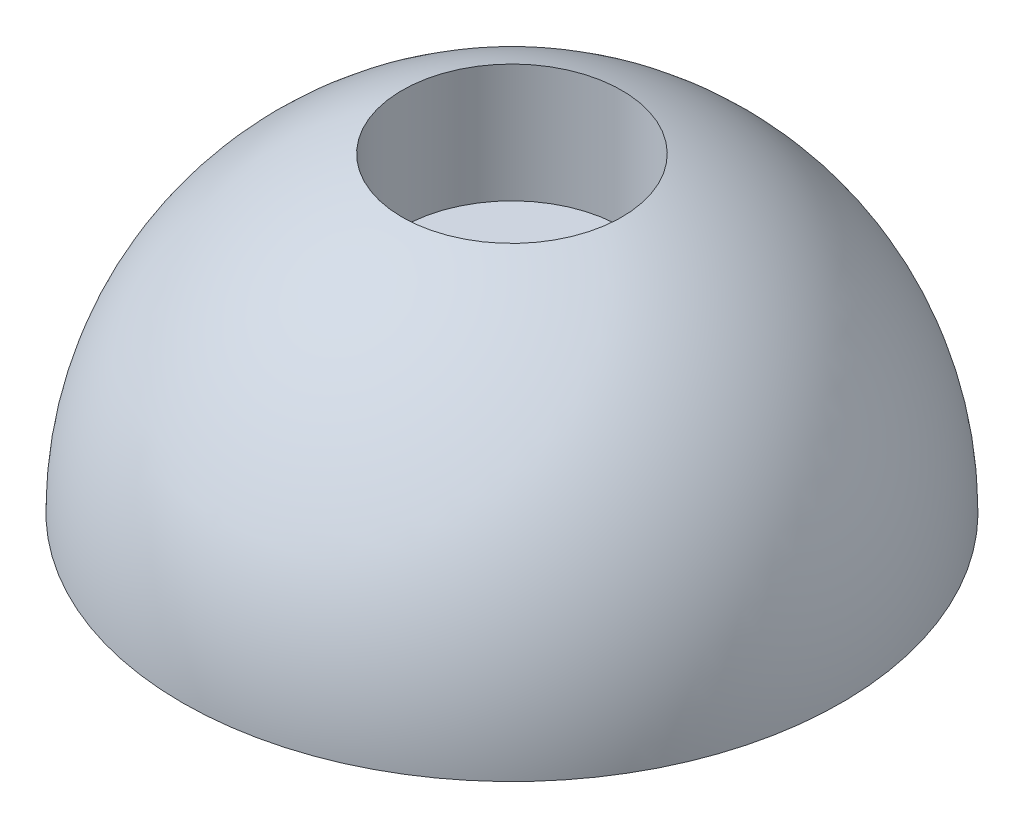
ISO-10303-21;
HEADER;
FILE_DESCRIPTION(('STEP AP214'),'2;1');
FILE_NAME('part.step','',(''),(''),'','','');
FILE_SCHEMA(('AUTOMOTIVE_DESIGN { 1 0 10303 214 1 1 1 1 }'));
ENDSEC;
DATA;
#1=APPLICATION_CONTEXT('core data for automotive mechanical design processes');
#2=APPLICATION_PROTOCOL_DEFINITION('international standard','automotive_design',2000,#1);
#3=PRODUCT_CONTEXT('',#1,'mechanical');
#4=PRODUCT('Part','Part','',(#3));
#5=PRODUCT_RELATED_PRODUCT_CATEGORY('part','',(#4));
#6=PRODUCT_DEFINITION_FORMATION('','',#4);
#7=PRODUCT_DEFINITION_CONTEXT('part definition',#1,'design');
#8=PRODUCT_DEFINITION('design','',#6,#7);
#9=PRODUCT_DEFINITION_SHAPE('','',#8);
#10=(LENGTH_UNIT() NAMED_UNIT(*) SI_UNIT(.MILLI.,.METRE.));
#11=(NAMED_UNIT(*) PLANE_ANGLE_UNIT() SI_UNIT($,.RADIAN.));
#12=(NAMED_UNIT(*) SI_UNIT($,.STERADIAN.) SOLID_ANGLE_UNIT());
#13=UNCERTAINTY_MEASURE_WITH_UNIT(LENGTH_MEASURE(1.E-05),#10,'distance_accuracy_value','');
#14=(GEOMETRIC_REPRESENTATION_CONTEXT(3) GLOBAL_UNCERTAINTY_ASSIGNED_CONTEXT((#13)) GLOBAL_UNIT_ASSIGNED_CONTEXT((#10,
#11,#12)) REPRESENTATION_CONTEXT('',''));
#15=CARTESIAN_POINT('',(0.,0.,0.));
#16=DIRECTION('',(0.,0.,1.));
#17=DIRECTION('',(1.,0.,0.));
#18=AXIS2_PLACEMENT_3D('',#15,#16,#17);
#19=CARTESIAN_POINT('',(0.,-8.334375,0.));
#20=DIRECTION('',(0.,1.,0.));
#21=DIRECTION('',(0.,0.,1.));
#22=AXIS2_PLACEMENT_3D('',#19,#20,#21);
#23=PLANE('',#22);
#24=CARTESIAN_POINT('',(0.,-8.334375,0.));
#25=DIRECTION('',(0.,1.,0.));
#26=DIRECTION('',(0.,0.,1.));
#27=AXIS2_PLACEMENT_3D('',#24,#25,#26);
#28=CIRCLE('',#27,19.05);
#29=CARTESIAN_POINT('',(0.,-8.334375,19.05));
#30=VERTEX_POINT('',#29);
#31=EDGE_CURVE('E10',#30,#30,#28,.T.);
#32=ORIENTED_EDGE('',*,*,#31,.F.);
#33=EDGE_LOOP('',(#32));
#34=FACE_BOUND('',#33,.T.);
#35=CARTESIAN_POINT('',(0.,-8.334375,0.));
#36=DIRECTION('',(0.,1.,0.));
#37=DIRECTION('',(0.,0.,1.));
#38=AXIS2_PLACEMENT_3D('',#35,#36,#37);
#39=CIRCLE('',#38,6.35);
#40=CARTESIAN_POINT('',(0.,-8.334375,6.35));
#41=VERTEX_POINT('',#40);
#42=EDGE_CURVE('E61',#41,#41,#39,.T.);
#43=ORIENTED_EDGE('',*,*,#42,.T.);
#44=EDGE_LOOP('',(#43));
#45=FACE_BOUND('',#44,.T.);
#46=ADVANCED_FACE('F36',(#34,#45),#23,.F.);
#47=CARTESIAN_POINT('',(0.,-8.334375,0.));
#48=DIRECTION('',(0.,1.,0.));
#49=DIRECTION('',(1.,0.,0.));
#50=AXIS2_PLACEMENT_3D('',#47,#48,#49);
#51=SPHERICAL_SURFACE('',#50,19.05);
#52=CARTESIAN_POINT('',(0.,9.62613724213831,0.));
#53=DIRECTION('',(0.,1.,0.));
#54=DIRECTION('',(0.,0.,1.));
#55=AXIS2_PLACEMENT_3D('',#52,#53,#54);
#56=CIRCLE('',#55,6.35);
#57=CARTESIAN_POINT('',(0.,9.62613724213831,6.35));
#58=VERTEX_POINT('',#57);
#59=EDGE_CURVE('E42',#58,#58,#56,.T.);
#60=ORIENTED_EDGE('',*,*,#59,.F.);
#61=EDGE_LOOP('',(#60));
#62=FACE_BOUND('',#61,.T.);
#63=ORIENTED_EDGE('',*,*,#31,.T.);
#64=EDGE_LOOP('',(#63));
#65=FACE_BOUND('',#64,.T.);
#66=ADVANCED_FACE('F78',(#62,#65),#51,.T.);
#67=CARTESIAN_POINT('',(0.,-2.778125,0.));
#68=DIRECTION('',(0.,1.,0.));
#69=DIRECTION('',(0.,0.,1.));
#70=AXIS2_PLACEMENT_3D('',#67,#68,#69);
#71=CYLINDRICAL_SURFACE('',#70,6.35);
#72=ORIENTED_EDGE('',*,*,#59,.T.);
#73=EDGE_LOOP('',(#72));
#74=FACE_BOUND('',#73,.T.);
#75=CARTESIAN_POINT('',(0.,2.778125,0.));
#76=DIRECTION('',(0.,1.,0.));
#77=DIRECTION('',(0.,0.,1.));
#78=AXIS2_PLACEMENT_3D('',#75,#76,#77);
#79=CIRCLE('',#78,6.35);
#80=CARTESIAN_POINT('',(0.,2.778125,6.35));
#81=VERTEX_POINT('',#80);
#82=EDGE_CURVE('E46',#81,#81,#79,.T.);
#83=ORIENTED_EDGE('',*,*,#82,.F.);
#84=EDGE_LOOP('',(#83));
#85=FACE_BOUND('',#84,.T.);
#86=ADVANCED_FACE('F83',(#74,#85),#71,.F.);
#87=CARTESIAN_POINT('',(0.,2.778125,0.));
#88=DIRECTION('',(0.,1.,0.));
#89=DIRECTION('',(0.,0.,1.));
#90=AXIS2_PLACEMENT_3D('',#87,#88,#89);
#91=PLANE('',#90);
#92=ORIENTED_EDGE('',*,*,#82,.T.);
#93=EDGE_LOOP('',(#92));
#94=FACE_BOUND('',#93,.T.);
#95=CARTESIAN_POINT('',(0.,2.778125,0.));
#96=DIRECTION('',(0.,1.,0.));
#97=DIRECTION('',(0.,0.,1.));
#98=AXIS2_PLACEMENT_3D('',#95,#96,#97);
#99=CIRCLE('',#98,3.302);
#100=CARTESIAN_POINT('',(0.,2.778125,3.302));
#101=VERTEX_POINT('',#100);
#102=EDGE_CURVE('E50',#101,#101,#99,.T.);
#103=ORIENTED_EDGE('',*,*,#102,.F.);
#104=EDGE_LOOP('',(#103));
#105=FACE_BOUND('',#104,.T.);
#106=ADVANCED_FACE('F88',(#94,#105),#91,.T.);
#107=CARTESIAN_POINT('',(0.,-2.778125,0.));
#108=DIRECTION('',(0.,1.,0.));
#109=DIRECTION('',(0.,0.,1.));
#110=AXIS2_PLACEMENT_3D('',#107,#108,#109);
#111=CYLINDRICAL_SURFACE('',#110,3.302);
#112=ORIENTED_EDGE('',*,*,#102,.T.);
#113=EDGE_LOOP('',(#112));
#114=FACE_BOUND('',#113,.T.);
#115=CARTESIAN_POINT('',(0.,-2.778125,0.));
#116=DIRECTION('',(0.,1.,0.));
#117=DIRECTION('',(0.,0.,1.));
#118=AXIS2_PLACEMENT_3D('',#115,#116,#117);
#119=CIRCLE('',#118,3.302);
#120=CARTESIAN_POINT('',(0.,-2.778125,3.302));
#121=VERTEX_POINT('',#120);
#122=EDGE_CURVE('E55',#121,#121,#119,.T.);
#123=ORIENTED_EDGE('',*,*,#122,.F.);
#124=EDGE_LOOP('',(#123));
#125=FACE_BOUND('',#124,.T.);
#126=ADVANCED_FACE('F74',(#114,#125),#111,.F.);
#127=CARTESIAN_POINT('',(0.,-2.778125,0.));
#128=DIRECTION('',(0.,1.,0.));
#129=DIRECTION('',(0.,0.,1.));
#130=AXIS2_PLACEMENT_3D('',#127,#128,#129);
#131=PLANE('',#130);
#132=CARTESIAN_POINT('',(0.,-2.778125,0.));
#133=DIRECTION('',(0.,1.,0.));
#134=DIRECTION('',(0.,0.,1.));
#135=AXIS2_PLACEMENT_3D('',#132,#133,#134);
#136=CIRCLE('',#135,6.35);
#137=CARTESIAN_POINT('',(0.,-2.778125,6.35));
#138=VERTEX_POINT('',#137);
#139=EDGE_CURVE('E58',#138,#138,#136,.T.);
#140=ORIENTED_EDGE('',*,*,#139,.F.);
#141=EDGE_LOOP('',(#140));
#142=FACE_BOUND('',#141,.T.);
#143=ORIENTED_EDGE('',*,*,#122,.T.);
#144=EDGE_LOOP('',(#143));
#145=FACE_BOUND('',#144,.T.);
#146=ADVANCED_FACE('F68',(#142,#145),#131,.F.);
#147=CARTESIAN_POINT('',(0.,-2.778125,0.));
#148=DIRECTION('',(0.,1.,0.));
#149=DIRECTION('',(0.,0.,1.));
#150=AXIS2_PLACEMENT_3D('',#147,#148,#149);
#151=CYLINDRICAL_SURFACE('',#150,6.35);
#152=ORIENTED_EDGE('',*,*,#139,.T.);
#153=EDGE_LOOP('',(#152));
#154=FACE_BOUND('',#153,.T.);
#155=ORIENTED_EDGE('',*,*,#42,.F.);
#156=EDGE_LOOP('',(#155));
#157=FACE_BOUND('',#156,.T.);
#158=ADVANCED_FACE('F66',(#154,#157),#151,.F.);
#159=CLOSED_SHELL('',(#46,#66,#86,#106,#126,#146,#158));
#160=MANIFOLD_SOLID_BREP('B2',#159);
#161=ADVANCED_BREP_SHAPE_REPRESENTATION('',(#18,#160),#14);
#162=SHAPE_DEFINITION_REPRESENTATION(#9,#161);
ENDSEC;
END-ISO-10303-21;
